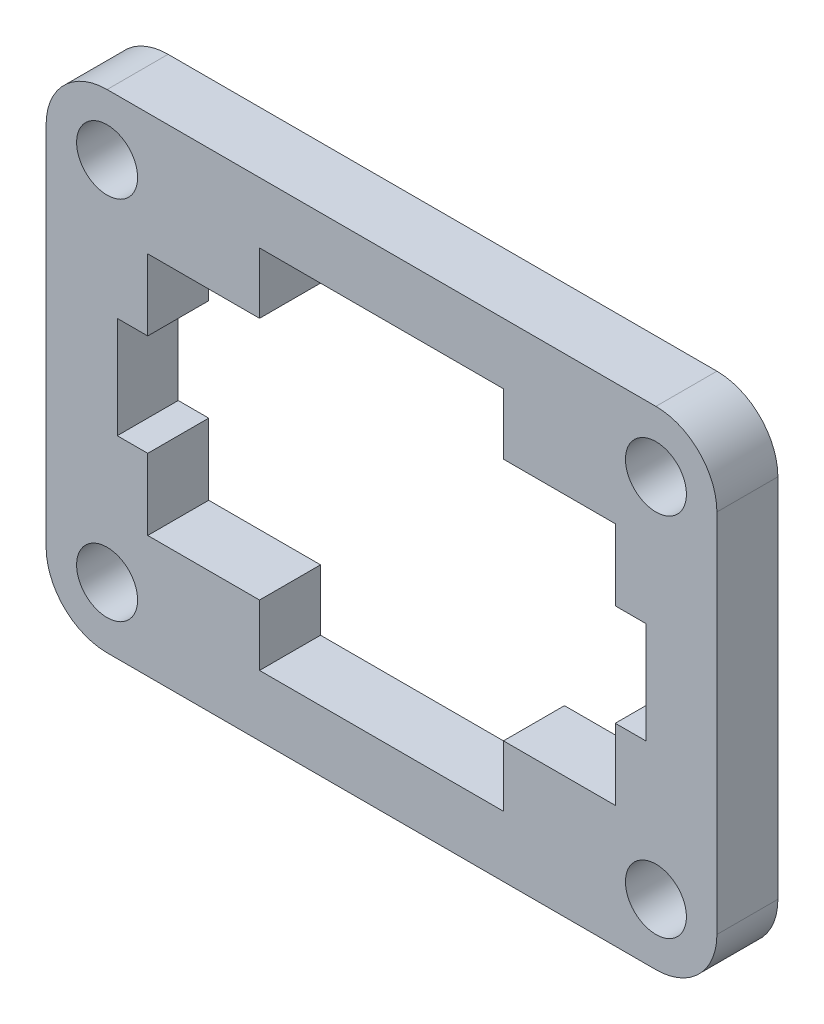
ISO-10303-21;
HEADER;
FILE_DESCRIPTION(('STEP AP214'),'2;1');
FILE_NAME('part.step','',(''),(''),'','','');
FILE_SCHEMA(('AUTOMOTIVE_DESIGN { 1 0 10303 214 1 1 1 1 }'));
ENDSEC;
DATA;
#1=APPLICATION_CONTEXT('core data for automotive mechanical design processes');
#2=APPLICATION_PROTOCOL_DEFINITION('international standard','automotive_design',2000,#1);
#3=PRODUCT_CONTEXT('',#1,'mechanical');
#4=PRODUCT('Part','Part','',(#3));
#5=PRODUCT_RELATED_PRODUCT_CATEGORY('part','',(#4));
#6=PRODUCT_DEFINITION_FORMATION('','',#4);
#7=PRODUCT_DEFINITION_CONTEXT('part definition',#1,'design');
#8=PRODUCT_DEFINITION('design','',#6,#7);
#9=PRODUCT_DEFINITION_SHAPE('','',#8);
#10=(LENGTH_UNIT() NAMED_UNIT(*) SI_UNIT(.MILLI.,.METRE.));
#11=(NAMED_UNIT(*) PLANE_ANGLE_UNIT() SI_UNIT($,.RADIAN.));
#12=(NAMED_UNIT(*) SI_UNIT($,.STERADIAN.) SOLID_ANGLE_UNIT());
#13=UNCERTAINTY_MEASURE_WITH_UNIT(LENGTH_MEASURE(1.E-05),#10,'distance_accuracy_value','');
#14=(GEOMETRIC_REPRESENTATION_CONTEXT(3) GLOBAL_UNCERTAINTY_ASSIGNED_CONTEXT((#13)) GLOBAL_UNIT_ASSIGNED_CONTEXT((#10,
#11,#12)) REPRESENTATION_CONTEXT('',''));
#15=CARTESIAN_POINT('',(0.,0.,0.));
#16=DIRECTION('',(0.,0.,1.));
#17=DIRECTION('',(1.,0.,0.));
#18=AXIS2_PLACEMENT_3D('',#15,#16,#17);
#19=CARTESIAN_POINT('',(27.0302510086011,-31.6514477462077,3.));
#20=DIRECTION('',(0.,0.,1.));
#21=DIRECTION('',(1.,0.,0.));
#22=AXIS2_PLACEMENT_3D('',#19,#20,#21);
#23=PLANE('',#22);
#24=CARTESIAN_POINT('',(54.0302510086011,-31.6514477462077,3.));
#25=DIRECTION('',(0.,0.,1.));
#26=DIRECTION('',(1.,0.,0.));
#27=AXIS2_PLACEMENT_3D('',#24,#25,#26);
#28=CIRCLE('',#27,1.5);
#29=CARTESIAN_POINT('',(55.5302510086011,-31.6514477462077,3.));
#30=VERTEX_POINT('',#29);
#31=EDGE_CURVE('E599',#30,#30,#28,.T.);
#32=ORIENTED_EDGE('',*,*,#31,.F.);
#33=EDGE_LOOP('',(#32));
#34=FACE_BOUND('',#33,.T.);
#35=CARTESIAN_POINT('',(27.0302510086011,-13.6514477462077,3.));
#36=DIRECTION('',(0.,0.,1.));
#37=DIRECTION('',(1.,0.,0.));
#38=AXIS2_PLACEMENT_3D('',#35,#36,#37);
#39=CIRCLE('',#38,1.5);
#40=CARTESIAN_POINT('',(28.5302510086011,-13.6514477462077,3.));
#41=VERTEX_POINT('',#40);
#42=EDGE_CURVE('E286',#41,#41,#39,.T.);
#43=ORIENTED_EDGE('',*,*,#42,.F.);
#44=EDGE_LOOP('',(#43));
#45=FACE_BOUND('',#44,.T.);
#46=CARTESIAN_POINT('',(27.0302510086011,-31.6514477462077,3.));
#47=DIRECTION('',(0.,0.,1.));
#48=DIRECTION('',(1.,0.,0.));
#49=AXIS2_PLACEMENT_3D('',#46,#47,#48);
#50=CIRCLE('',#49,3.);
#51=CARTESIAN_POINT('',(24.0302510086011,-31.6514477462077,3.));
#52=VERTEX_POINT('',#51);
#53=CARTESIAN_POINT('',(27.0302510086011,-34.6514477462077,3.));
#54=VERTEX_POINT('',#53);
#55=EDGE_CURVE('E376',#52,#54,#50,.T.);
#56=ORIENTED_EDGE('',*,*,#55,.T.);
#57=DIRECTION('',(1.,0.,0.));
#58=VECTOR('',#57,1.);
#59=CARTESIAN_POINT('',(27.0302510086011,-34.6514477462077,3.));
#60=LINE('',#59,#58);
#61=CARTESIAN_POINT('',(54.0302510086011,-34.6514477462077,3.));
#62=VERTEX_POINT('',#61);
#63=EDGE_CURVE('E379',#54,#62,#60,.T.);
#64=ORIENTED_EDGE('',*,*,#63,.T.);
#65=CARTESIAN_POINT('',(54.0302510086011,-31.6514477462077,3.));
#66=DIRECTION('',(0.,0.,1.));
#67=DIRECTION('',(1.,0.,0.));
#68=AXIS2_PLACEMENT_3D('',#65,#66,#67);
#69=CIRCLE('',#68,3.);
#70=CARTESIAN_POINT('',(57.0302510086011,-31.6514477462077,3.));
#71=VERTEX_POINT('',#70);
#72=EDGE_CURVE('E382',#62,#71,#69,.T.);
#73=ORIENTED_EDGE('',*,*,#72,.T.);
#74=DIRECTION('',(0.,1.,0.));
#75=VECTOR('',#74,1.);
#76=CARTESIAN_POINT('',(57.0302510086011,-13.6514477462077,3.));
#77=LINE('',#76,#75);
#78=CARTESIAN_POINT('',(57.0302510086011,-13.6514477462077,3.));
#79=VERTEX_POINT('',#78);
#80=EDGE_CURVE('E384',#71,#79,#77,.T.);
#81=ORIENTED_EDGE('',*,*,#80,.T.);
#82=CARTESIAN_POINT('',(54.0302510086011,-13.6514477462077,3.));
#83=DIRECTION('',(0.,0.,1.));
#84=DIRECTION('',(-1.,0.,0.));
#85=AXIS2_PLACEMENT_3D('',#82,#83,#84);
#86=CIRCLE('',#85,3.);
#87=CARTESIAN_POINT('',(54.0302510086011,-10.6514477462077,3.));
#88=VERTEX_POINT('',#87);
#89=EDGE_CURVE('E386',#79,#88,#86,.T.);
#90=ORIENTED_EDGE('',*,*,#89,.T.);
#91=DIRECTION('',(-1.,0.,0.));
#92=VECTOR('',#91,1.);
#93=CARTESIAN_POINT('',(27.0302510086011,-10.6514477462077,3.));
#94=LINE('',#93,#92);
#95=CARTESIAN_POINT('',(27.0302510086011,-10.6514477462077,3.));
#96=VERTEX_POINT('',#95);
#97=EDGE_CURVE('E388',#88,#96,#94,.T.);
#98=ORIENTED_EDGE('',*,*,#97,.T.);
#99=CARTESIAN_POINT('',(27.0302510086011,-13.6514477462077,3.));
#100=DIRECTION('',(0.,0.,1.));
#101=DIRECTION('',(1.,0.,0.));
#102=AXIS2_PLACEMENT_3D('',#99,#100,#101);
#103=CIRCLE('',#102,3.);
#104=CARTESIAN_POINT('',(24.0302510086011,-13.6514477462077,3.));
#105=VERTEX_POINT('',#104);
#106=EDGE_CURVE('E390',#96,#105,#103,.T.);
#107=ORIENTED_EDGE('',*,*,#106,.T.);
#108=DIRECTION('',(0.,-1.,0.));
#109=VECTOR('',#108,1.);
#110=CARTESIAN_POINT('',(24.0302510086011,-13.6514477462077,3.));
#111=LINE('',#110,#109);
#112=EDGE_CURVE('E392',#105,#52,#111,.T.);
#113=ORIENTED_EDGE('',*,*,#112,.T.);
#114=EDGE_LOOP('',(#56,#64,#73,#81,#90,#98,#107,#113));
#115=FACE_BOUND('',#114,.T.);
#116=DIRECTION('',(1.,0.,0.));
#117=VECTOR('',#116,1.);
#118=CARTESIAN_POINT('',(29.0302510086011,-28.6514477462077,3.));
#119=LINE('',#118,#117);
#120=CARTESIAN_POINT('',(29.0302510086011,-28.6514477462077,3.));
#121=VERTEX_POINT('',#120);
#122=CARTESIAN_POINT('',(34.5302510086011,-28.6514477462077,3.));
#123=VERTEX_POINT('',#122);
#124=EDGE_CURVE('E232',#121,#123,#119,.T.);
#125=ORIENTED_EDGE('',*,*,#124,.F.);
#126=DIRECTION('',(0.,-1.,0.));
#127=VECTOR('',#126,1.);
#128=CARTESIAN_POINT('',(29.0302510086011,-28.6514477462077,3.));
#129=LINE('',#128,#127);
#130=CARTESIAN_POINT('',(29.0302510086011,-25.1514477462077,3.));
#131=VERTEX_POINT('',#130);
#132=EDGE_CURVE('E224',#131,#121,#129,.T.);
#133=ORIENTED_EDGE('',*,*,#132,.F.);
#134=DIRECTION('',(1.,0.,0.));
#135=VECTOR('',#134,1.);
#136=CARTESIAN_POINT('',(27.5302510086011,-25.1514477462077,3.));
#137=LINE('',#136,#135);
#138=CARTESIAN_POINT('',(27.5302510086011,-25.1514477462077,3.));
#139=VERTEX_POINT('',#138);
#140=EDGE_CURVE('E283',#139,#131,#137,.T.);
#141=ORIENTED_EDGE('',*,*,#140,.F.);
#142=DIRECTION('',(0.,-1.,0.));
#143=VECTOR('',#142,1.);
#144=CARTESIAN_POINT('',(27.5302510086011,-20.1514477462077,3.));
#145=LINE('',#144,#143);
#146=CARTESIAN_POINT('',(27.5302510086011,-20.1514477462077,3.));
#147=VERTEX_POINT('',#146);
#148=EDGE_CURVE('E281',#147,#139,#145,.T.);
#149=ORIENTED_EDGE('',*,*,#148,.F.);
#150=DIRECTION('',(-1.,0.,0.));
#151=VECTOR('',#150,1.);
#152=CARTESIAN_POINT('',(27.5302510086011,-20.1514477462077,3.));
#153=LINE('',#152,#151);
#154=CARTESIAN_POINT('',(29.0302510086011,-20.1514477462077,3.));
#155=VERTEX_POINT('',#154);
#156=EDGE_CURVE('E279',#155,#147,#153,.T.);
#157=ORIENTED_EDGE('',*,*,#156,.F.);
#158=DIRECTION('',(0.,-1.,0.));
#159=VECTOR('',#158,1.);
#160=CARTESIAN_POINT('',(29.0302510086011,-20.1514477462077,3.));
#161=LINE('',#160,#159);
#162=CARTESIAN_POINT('',(29.0302510086011,-16.6514477462077,3.));
#163=VERTEX_POINT('',#162);
#164=EDGE_CURVE('E277',#163,#155,#161,.T.);
#165=ORIENTED_EDGE('',*,*,#164,.F.);
#166=DIRECTION('',(-1.,0.,0.));
#167=VECTOR('',#166,1.);
#168=CARTESIAN_POINT('',(29.0302510086011,-16.6514477462077,3.));
#169=LINE('',#168,#167);
#170=CARTESIAN_POINT('',(34.5302510086011,-16.6514477462077,3.));
#171=VERTEX_POINT('',#170);
#172=EDGE_CURVE('E275',#171,#163,#169,.T.);
#173=ORIENTED_EDGE('',*,*,#172,.F.);
#174=DIRECTION('',(0.,-1.,0.));
#175=VECTOR('',#174,1.);
#176=CARTESIAN_POINT('',(34.5302510086011,-16.6514477462077,3.));
#177=LINE('',#176,#175);
#178=CARTESIAN_POINT('',(34.5302510086011,-13.6514477462077,3.));
#179=VERTEX_POINT('',#178);
#180=EDGE_CURVE('E273',#179,#171,#177,.T.);
#181=ORIENTED_EDGE('',*,*,#180,.F.);
#182=DIRECTION('',(-1.,0.,0.));
#183=VECTOR('',#182,1.);
#184=CARTESIAN_POINT('',(46.5302510086011,-13.6514477462077,3.));
#185=LINE('',#184,#183);
#186=CARTESIAN_POINT('',(46.5302510086011,-13.6514477462077,3.));
#187=VERTEX_POINT('',#186);
#188=EDGE_CURVE('E271',#187,#179,#185,.T.);
#189=ORIENTED_EDGE('',*,*,#188,.F.);
#190=DIRECTION('',(0.,1.,0.));
#191=VECTOR('',#190,1.);
#192=CARTESIAN_POINT('',(46.5302510086011,-16.6514477462077,3.));
#193=LINE('',#192,#191);
#194=CARTESIAN_POINT('',(46.5302510086011,-16.6514477462077,3.));
#195=VERTEX_POINT('',#194);
#196=EDGE_CURVE('E269',#195,#187,#193,.T.);
#197=ORIENTED_EDGE('',*,*,#196,.F.);
#198=DIRECTION('',(-1.,0.,0.));
#199=VECTOR('',#198,1.);
#200=CARTESIAN_POINT('',(46.5302510086011,-16.6514477462077,3.));
#201=LINE('',#200,#199);
#202=CARTESIAN_POINT('',(52.0302510086011,-16.6514477462077,3.));
#203=VERTEX_POINT('',#202);
#204=EDGE_CURVE('E267',#203,#195,#201,.T.);
#205=ORIENTED_EDGE('',*,*,#204,.F.);
#206=DIRECTION('',(0.,1.,0.));
#207=VECTOR('',#206,1.);
#208=CARTESIAN_POINT('',(52.0302510086011,-20.1514477462077,3.));
#209=LINE('',#208,#207);
#210=CARTESIAN_POINT('',(52.0302510086011,-20.1514477462077,3.));
#211=VERTEX_POINT('',#210);
#212=EDGE_CURVE('E265',#211,#203,#209,.T.);
#213=ORIENTED_EDGE('',*,*,#212,.F.);
#214=DIRECTION('',(-1.,0.,0.));
#215=VECTOR('',#214,1.);
#216=CARTESIAN_POINT('',(52.0302510086011,-20.1514477462077,3.));
#217=LINE('',#216,#215);
#218=CARTESIAN_POINT('',(53.5302510086011,-20.1514477462077,3.));
#219=VERTEX_POINT('',#218);
#220=EDGE_CURVE('E263',#219,#211,#217,.T.);
#221=ORIENTED_EDGE('',*,*,#220,.F.);
#222=DIRECTION('',(0.,1.,0.));
#223=VECTOR('',#222,1.);
#224=CARTESIAN_POINT('',(53.5302510086011,-20.1514477462077,3.));
#225=LINE('',#224,#223);
#226=CARTESIAN_POINT('',(53.5302510086011,-25.1514477462077,3.));
#227=VERTEX_POINT('',#226);
#228=EDGE_CURVE('E261',#227,#219,#225,.T.);
#229=ORIENTED_EDGE('',*,*,#228,.F.);
#230=DIRECTION('',(1.,0.,0.));
#231=VECTOR('',#230,1.);
#232=CARTESIAN_POINT('',(52.0302510086011,-25.1514477462077,3.));
#233=LINE('',#232,#231);
#234=CARTESIAN_POINT('',(52.0302510086011,-25.1514477462077,3.));
#235=VERTEX_POINT('',#234);
#236=EDGE_CURVE('E259',#235,#227,#233,.T.);
#237=ORIENTED_EDGE('',*,*,#236,.F.);
#238=DIRECTION('',(0.,1.,0.));
#239=VECTOR('',#238,1.);
#240=CARTESIAN_POINT('',(52.0302510086011,-28.6514477462077,3.));
#241=LINE('',#240,#239);
#242=CARTESIAN_POINT('',(52.0302510086011,-28.6514477462077,3.));
#243=VERTEX_POINT('',#242);
#244=EDGE_CURVE('E257',#243,#235,#241,.T.);
#245=ORIENTED_EDGE('',*,*,#244,.F.);
#246=DIRECTION('',(1.,0.,0.));
#247=VECTOR('',#246,1.);
#248=CARTESIAN_POINT('',(46.5302510086011,-28.6514477462077,3.));
#249=LINE('',#248,#247);
#250=CARTESIAN_POINT('',(46.5302510086011,-28.6514477462077,3.));
#251=VERTEX_POINT('',#250);
#252=EDGE_CURVE('E255',#251,#243,#249,.T.);
#253=ORIENTED_EDGE('',*,*,#252,.F.);
#254=DIRECTION('',(0.,1.,0.));
#255=VECTOR('',#254,1.);
#256=CARTESIAN_POINT('',(46.5302510086011,-31.6514477462077,3.));
#257=LINE('',#256,#255);
#258=CARTESIAN_POINT('',(46.5302510086011,-31.6514477462077,3.));
#259=VERTEX_POINT('',#258);
#260=EDGE_CURVE('E253',#259,#251,#257,.T.);
#261=ORIENTED_EDGE('',*,*,#260,.F.);
#262=DIRECTION('',(1.,0.,0.));
#263=VECTOR('',#262,1.);
#264=CARTESIAN_POINT('',(46.5302510086011,-31.6514477462077,3.));
#265=LINE('',#264,#263);
#266=CARTESIAN_POINT('',(34.5302510086011,-31.6514477462077,3.));
#267=VERTEX_POINT('',#266);
#268=EDGE_CURVE('E248',#267,#259,#265,.T.);
#269=ORIENTED_EDGE('',*,*,#268,.F.);
#270=DIRECTION('',(0.,-1.,0.));
#271=VECTOR('',#270,1.);
#272=CARTESIAN_POINT('',(34.5302510086011,-31.6514477462077,3.));
#273=LINE('',#272,#271);
#274=EDGE_CURVE('E246',#123,#267,#273,.T.);
#275=ORIENTED_EDGE('',*,*,#274,.F.);
#276=EDGE_LOOP('',(#125,#133,#141,#149,#157,#165,#173,#181,#189,#197,#205,#213,#221,#229,#237,
#245,#253,#261,#269,#275));
#277=FACE_BOUND('',#276,.T.);
#278=CARTESIAN_POINT('',(54.0302510086011,-13.6514477462077,3.));
#279=DIRECTION('',(0.,0.,1.));
#280=DIRECTION('',(1.,0.,0.));
#281=AXIS2_PLACEMENT_3D('',#278,#279,#280);
#282=CIRCLE('',#281,1.5);
#283=CARTESIAN_POINT('',(55.5302510086011,-13.6514477462077,3.));
#284=VERTEX_POINT('',#283);
#285=EDGE_CURVE('E605',#284,#284,#282,.T.);
#286=ORIENTED_EDGE('',*,*,#285,.F.);
#287=EDGE_LOOP('',(#286));
#288=FACE_BOUND('',#287,.T.);
#289=CARTESIAN_POINT('',(27.0302510086011,-31.6514477462077,3.));
#290=DIRECTION('',(0.,0.,1.));
#291=DIRECTION('',(1.,0.,0.));
#292=AXIS2_PLACEMENT_3D('',#289,#290,#291);
#293=CIRCLE('',#292,1.5);
#294=CARTESIAN_POINT('',(28.5302510086011,-31.6514477462077,3.));
#295=VERTEX_POINT('',#294);
#296=EDGE_CURVE('E590',#295,#295,#293,.T.);
#297=ORIENTED_EDGE('',*,*,#296,.F.);
#298=EDGE_LOOP('',(#297));
#299=FACE_BOUND('',#298,.T.);
#300=ADVANCED_FACE('F39',(#34,#45,#115,#277,#288,#299),#23,.T.);
#301=CARTESIAN_POINT('',(27.0302510086011,-31.6514477462077,0.));
#302=DIRECTION('',(0.,0.,1.));
#303=DIRECTION('',(1.,0.,0.));
#304=AXIS2_PLACEMENT_3D('',#301,#302,#303);
#305=PLANE('',#304);
#306=CARTESIAN_POINT('',(54.0302510086011,-31.6514477462077,0.));
#307=DIRECTION('',(0.,0.,1.));
#308=DIRECTION('',(1.,0.,0.));
#309=AXIS2_PLACEMENT_3D('',#306,#307,#308);
#310=CIRCLE('',#309,1.5);
#311=CARTESIAN_POINT('',(55.5302510086011,-31.6514477462077,0.));
#312=VERTEX_POINT('',#311);
#313=EDGE_CURVE('E596',#312,#312,#310,.T.);
#314=ORIENTED_EDGE('',*,*,#313,.T.);
#315=EDGE_LOOP('',(#314));
#316=FACE_BOUND('',#315,.T.);
#317=CARTESIAN_POINT('',(27.0302510086011,-13.6514477462077,0.));
#318=DIRECTION('',(0.,0.,1.));
#319=DIRECTION('',(1.,0.,0.));
#320=AXIS2_PLACEMENT_3D('',#317,#318,#319);
#321=CIRCLE('',#320,1.5);
#322=CARTESIAN_POINT('',(28.5302510086011,-13.6514477462077,0.));
#323=VERTEX_POINT('',#322);
#324=EDGE_CURVE('E608',#323,#323,#321,.T.);
#325=ORIENTED_EDGE('',*,*,#324,.T.);
#326=EDGE_LOOP('',(#325));
#327=FACE_BOUND('',#326,.T.);
#328=CARTESIAN_POINT('',(27.0302510086011,-31.6514477462077,0.));
#329=DIRECTION('',(0.,0.,1.));
#330=DIRECTION('',(1.,0.,0.));
#331=AXIS2_PLACEMENT_3D('',#328,#329,#330);
#332=CIRCLE('',#331,3.);
#333=CARTESIAN_POINT('',(24.0302510086011,-31.6514477462077,0.));
#334=VERTEX_POINT('',#333);
#335=CARTESIAN_POINT('',(27.0302510086011,-34.6514477462077,0.));
#336=VERTEX_POINT('',#335);
#337=EDGE_CURVE('E240',#334,#336,#332,.T.);
#338=ORIENTED_EDGE('',*,*,#337,.F.);
#339=DIRECTION('',(0.,-1.,0.));
#340=VECTOR('',#339,1.);
#341=CARTESIAN_POINT('',(24.0302510086011,-13.6514477462077,0.));
#342=LINE('',#341,#340);
#343=CARTESIAN_POINT('',(24.0302510086011,-13.6514477462077,0.));
#344=VERTEX_POINT('',#343);
#345=EDGE_CURVE('E380',#344,#334,#342,.T.);
#346=ORIENTED_EDGE('',*,*,#345,.F.);
#347=CARTESIAN_POINT('',(27.0302510086011,-13.6514477462077,0.));
#348=DIRECTION('',(0.,0.,1.));
#349=DIRECTION('',(1.,0.,0.));
#350=AXIS2_PLACEMENT_3D('',#347,#348,#349);
#351=CIRCLE('',#350,3.);
#352=CARTESIAN_POINT('',(27.0302510086011,-10.6514477462077,0.));
#353=VERTEX_POINT('',#352);
#354=EDGE_CURVE('E407',#353,#344,#351,.T.);
#355=ORIENTED_EDGE('',*,*,#354,.F.);
#356=DIRECTION('',(-1.,0.,0.));
#357=VECTOR('',#356,1.);
#358=CARTESIAN_POINT('',(27.0302510086011,-10.6514477462077,0.));
#359=LINE('',#358,#357);
#360=CARTESIAN_POINT('',(54.0302510086011,-10.6514477462077,0.));
#361=VERTEX_POINT('',#360);
#362=EDGE_CURVE('E405',#361,#353,#359,.T.);
#363=ORIENTED_EDGE('',*,*,#362,.F.);
#364=CARTESIAN_POINT('',(54.0302510086011,-13.6514477462077,0.));
#365=DIRECTION('',(0.,0.,1.));
#366=DIRECTION('',(-1.,0.,0.));
#367=AXIS2_PLACEMENT_3D('',#364,#365,#366);
#368=CIRCLE('',#367,3.);
#369=CARTESIAN_POINT('',(57.0302510086011,-13.6514477462077,0.));
#370=VERTEX_POINT('',#369);
#371=EDGE_CURVE('E403',#370,#361,#368,.T.);
#372=ORIENTED_EDGE('',*,*,#371,.F.);
#373=DIRECTION('',(0.,1.,0.));
#374=VECTOR('',#373,1.);
#375=CARTESIAN_POINT('',(57.0302510086011,-13.6514477462077,0.));
#376=LINE('',#375,#374);
#377=CARTESIAN_POINT('',(57.0302510086011,-31.6514477462077,0.));
#378=VERTEX_POINT('',#377);
#379=EDGE_CURVE('E401',#378,#370,#376,.T.);
#380=ORIENTED_EDGE('',*,*,#379,.F.);
#381=CARTESIAN_POINT('',(54.0302510086011,-31.6514477462077,0.));
#382=DIRECTION('',(0.,0.,1.));
#383=DIRECTION('',(1.,0.,0.));
#384=AXIS2_PLACEMENT_3D('',#381,#382,#383);
#385=CIRCLE('',#384,3.);
#386=CARTESIAN_POINT('',(54.0302510086011,-34.6514477462077,0.));
#387=VERTEX_POINT('',#386);
#388=EDGE_CURVE('E399',#387,#378,#385,.T.);
#389=ORIENTED_EDGE('',*,*,#388,.F.);
#390=DIRECTION('',(1.,0.,0.));
#391=VECTOR('',#390,1.);
#392=CARTESIAN_POINT('',(27.0302510086011,-34.6514477462077,0.));
#393=LINE('',#392,#391);
#394=EDGE_CURVE('E397',#336,#387,#393,.T.);
#395=ORIENTED_EDGE('',*,*,#394,.F.);
#396=EDGE_LOOP('',(#338,#346,#355,#363,#372,#380,#389,#395));
#397=FACE_BOUND('',#396,.T.);
#398=DIRECTION('',(0.,-1.,0.));
#399=VECTOR('',#398,1.);
#400=CARTESIAN_POINT('',(29.0302510086011,-28.6514477462077,0.));
#401=LINE('',#400,#399);
#402=CARTESIAN_POINT('',(29.0302510086011,-25.1514477462077,0.));
#403=VERTEX_POINT('',#402);
#404=CARTESIAN_POINT('',(29.0302510086011,-28.6514477462077,0.));
#405=VERTEX_POINT('',#404);
#406=EDGE_CURVE('E62',#403,#405,#401,.T.);
#407=ORIENTED_EDGE('',*,*,#406,.T.);
#408=DIRECTION('',(1.,0.,0.));
#409=VECTOR('',#408,1.);
#410=CARTESIAN_POINT('',(29.0302510086011,-28.6514477462077,0.));
#411=LINE('',#410,#409);
#412=CARTESIAN_POINT('',(34.5302510086011,-28.6514477462077,0.));
#413=VERTEX_POINT('',#412);
#414=EDGE_CURVE('E239',#405,#413,#411,.T.);
#415=ORIENTED_EDGE('',*,*,#414,.T.);
#416=DIRECTION('',(0.,-1.,0.));
#417=VECTOR('',#416,1.);
#418=CARTESIAN_POINT('',(34.5302510086011,-31.6514477462077,0.));
#419=LINE('',#418,#417);
#420=CARTESIAN_POINT('',(34.5302510086011,-31.6514477462077,0.));
#421=VERTEX_POINT('',#420);
#422=EDGE_CURVE('E288',#413,#421,#419,.T.);
#423=ORIENTED_EDGE('',*,*,#422,.T.);
#424=DIRECTION('',(1.,0.,0.));
#425=VECTOR('',#424,1.);
#426=CARTESIAN_POINT('',(46.5302510086011,-31.6514477462077,0.));
#427=LINE('',#426,#425);
#428=CARTESIAN_POINT('',(46.5302510086011,-31.6514477462077,0.));
#429=VERTEX_POINT('',#428);
#430=EDGE_CURVE('E291',#421,#429,#427,.T.);
#431=ORIENTED_EDGE('',*,*,#430,.T.);
#432=DIRECTION('',(0.,1.,0.));
#433=VECTOR('',#432,1.);
#434=CARTESIAN_POINT('',(46.5302510086011,-31.6514477462077,0.));
#435=LINE('',#434,#433);
#436=CARTESIAN_POINT('',(46.5302510086011,-28.6514477462077,0.));
#437=VERTEX_POINT('',#436);
#438=EDGE_CURVE('E294',#429,#437,#435,.T.);
#439=ORIENTED_EDGE('',*,*,#438,.T.);
#440=DIRECTION('',(1.,0.,0.));
#441=VECTOR('',#440,1.);
#442=CARTESIAN_POINT('',(46.5302510086011,-28.6514477462077,0.));
#443=LINE('',#442,#441);
#444=CARTESIAN_POINT('',(52.0302510086011,-28.6514477462077,0.));
#445=VERTEX_POINT('',#444);
#446=EDGE_CURVE('E297',#437,#445,#443,.T.);
#447=ORIENTED_EDGE('',*,*,#446,.T.);
#448=DIRECTION('',(0.,1.,0.));
#449=VECTOR('',#448,1.);
#450=CARTESIAN_POINT('',(52.0302510086011,-28.6514477462077,0.));
#451=LINE('',#450,#449);
#452=CARTESIAN_POINT('',(52.0302510086011,-25.1514477462077,0.));
#453=VERTEX_POINT('',#452);
#454=EDGE_CURVE('E300',#445,#453,#451,.T.);
#455=ORIENTED_EDGE('',*,*,#454,.T.);
#456=DIRECTION('',(1.,0.,0.));
#457=VECTOR('',#456,1.);
#458=CARTESIAN_POINT('',(52.0302510086011,-25.1514477462077,0.));
#459=LINE('',#458,#457);
#460=CARTESIAN_POINT('',(53.5302510086011,-25.1514477462077,0.));
#461=VERTEX_POINT('',#460);
#462=EDGE_CURVE('E303',#453,#461,#459,.T.);
#463=ORIENTED_EDGE('',*,*,#462,.T.);
#464=DIRECTION('',(0.,1.,0.));
#465=VECTOR('',#464,1.);
#466=CARTESIAN_POINT('',(53.5302510086011,-20.1514477462077,0.));
#467=LINE('',#466,#465);
#468=CARTESIAN_POINT('',(53.5302510086011,-20.1514477462077,0.));
#469=VERTEX_POINT('',#468);
#470=EDGE_CURVE('E306',#461,#469,#467,.T.);
#471=ORIENTED_EDGE('',*,*,#470,.T.);
#472=DIRECTION('',(-1.,0.,0.));
#473=VECTOR('',#472,1.);
#474=CARTESIAN_POINT('',(52.0302510086011,-20.1514477462077,0.));
#475=LINE('',#474,#473);
#476=CARTESIAN_POINT('',(52.0302510086011,-20.1514477462077,0.));
#477=VERTEX_POINT('',#476);
#478=EDGE_CURVE('E309',#469,#477,#475,.T.);
#479=ORIENTED_EDGE('',*,*,#478,.T.);
#480=DIRECTION('',(0.,1.,0.));
#481=VECTOR('',#480,1.);
#482=CARTESIAN_POINT('',(52.0302510086011,-20.1514477462077,0.));
#483=LINE('',#482,#481);
#484=CARTESIAN_POINT('',(52.0302510086011,-16.6514477462077,0.));
#485=VERTEX_POINT('',#484);
#486=EDGE_CURVE('E312',#477,#485,#483,.T.);
#487=ORIENTED_EDGE('',*,*,#486,.T.);
#488=DIRECTION('',(-1.,0.,0.));
#489=VECTOR('',#488,1.);
#490=CARTESIAN_POINT('',(46.5302510086011,-16.6514477462077,0.));
#491=LINE('',#490,#489);
#492=CARTESIAN_POINT('',(46.5302510086011,-16.6514477462077,0.));
#493=VERTEX_POINT('',#492);
#494=EDGE_CURVE('E315',#485,#493,#491,.T.);
#495=ORIENTED_EDGE('',*,*,#494,.T.);
#496=DIRECTION('',(0.,1.,0.));
#497=VECTOR('',#496,1.);
#498=CARTESIAN_POINT('',(46.5302510086011,-16.6514477462077,0.));
#499=LINE('',#498,#497);
#500=CARTESIAN_POINT('',(46.5302510086011,-13.6514477462077,0.));
#501=VERTEX_POINT('',#500);
#502=EDGE_CURVE('E318',#493,#501,#499,.T.);
#503=ORIENTED_EDGE('',*,*,#502,.T.);
#504=DIRECTION('',(-1.,0.,0.));
#505=VECTOR('',#504,1.);
#506=CARTESIAN_POINT('',(46.5302510086011,-13.6514477462077,0.));
#507=LINE('',#506,#505);
#508=CARTESIAN_POINT('',(34.5302510086011,-13.6514477462077,0.));
#509=VERTEX_POINT('',#508);
#510=EDGE_CURVE('E321',#501,#509,#507,.T.);
#511=ORIENTED_EDGE('',*,*,#510,.T.);
#512=DIRECTION('',(0.,-1.,0.));
#513=VECTOR('',#512,1.);
#514=CARTESIAN_POINT('',(34.5302510086011,-16.6514477462077,0.));
#515=LINE('',#514,#513);
#516=CARTESIAN_POINT('',(34.5302510086011,-16.6514477462077,0.));
#517=VERTEX_POINT('',#516);
#518=EDGE_CURVE('E324',#509,#517,#515,.T.);
#519=ORIENTED_EDGE('',*,*,#518,.T.);
#520=DIRECTION('',(-1.,0.,0.));
#521=VECTOR('',#520,1.);
#522=CARTESIAN_POINT('',(29.0302510086011,-16.6514477462077,0.));
#523=LINE('',#522,#521);
#524=CARTESIAN_POINT('',(29.0302510086011,-16.6514477462077,0.));
#525=VERTEX_POINT('',#524);
#526=EDGE_CURVE('E327',#517,#525,#523,.T.);
#527=ORIENTED_EDGE('',*,*,#526,.T.);
#528=DIRECTION('',(0.,-1.,0.));
#529=VECTOR('',#528,1.);
#530=CARTESIAN_POINT('',(29.0302510086011,-20.1514477462077,0.));
#531=LINE('',#530,#529);
#532=CARTESIAN_POINT('',(29.0302510086011,-20.1514477462077,0.));
#533=VERTEX_POINT('',#532);
#534=EDGE_CURVE('E330',#525,#533,#531,.T.);
#535=ORIENTED_EDGE('',*,*,#534,.T.);
#536=DIRECTION('',(-1.,0.,0.));
#537=VECTOR('',#536,1.);
#538=CARTESIAN_POINT('',(27.5302510086011,-20.1514477462077,0.));
#539=LINE('',#538,#537);
#540=CARTESIAN_POINT('',(27.5302510086011,-20.1514477462077,0.));
#541=VERTEX_POINT('',#540);
#542=EDGE_CURVE('E333',#533,#541,#539,.T.);
#543=ORIENTED_EDGE('',*,*,#542,.T.);
#544=DIRECTION('',(0.,-1.,0.));
#545=VECTOR('',#544,1.);
#546=CARTESIAN_POINT('',(27.5302510086011,-20.1514477462077,0.));
#547=LINE('',#546,#545);
#548=CARTESIAN_POINT('',(27.5302510086011,-25.1514477462077,0.));
#549=VERTEX_POINT('',#548);
#550=EDGE_CURVE('E336',#541,#549,#547,.T.);
#551=ORIENTED_EDGE('',*,*,#550,.T.);
#552=DIRECTION('',(1.,0.,0.));
#553=VECTOR('',#552,1.);
#554=CARTESIAN_POINT('',(27.5302510086011,-25.1514477462077,0.));
#555=LINE('',#554,#553);
#556=EDGE_CURVE('E233',#549,#403,#555,.T.);
#557=ORIENTED_EDGE('',*,*,#556,.T.);
#558=EDGE_LOOP('',(#407,#415,#423,#431,#439,#447,#455,#463,#471,#479,#487,#495,#503,#511,#519,
#527,#535,#543,#551,#557));
#559=FACE_BOUND('',#558,.T.);
#560=CARTESIAN_POINT('',(54.0302510086011,-13.6514477462077,0.));
#561=DIRECTION('',(0.,0.,1.));
#562=DIRECTION('',(1.,0.,0.));
#563=AXIS2_PLACEMENT_3D('',#560,#561,#562);
#564=CIRCLE('',#563,1.5);
#565=CARTESIAN_POINT('',(55.5302510086011,-13.6514477462077,0.));
#566=VERTEX_POINT('',#565);
#567=EDGE_CURVE('E602',#566,#566,#564,.T.);
#568=ORIENTED_EDGE('',*,*,#567,.T.);
#569=EDGE_LOOP('',(#568));
#570=FACE_BOUND('',#569,.T.);
#571=CARTESIAN_POINT('',(27.0302510086011,-31.6514477462077,0.));
#572=DIRECTION('',(0.,0.,1.));
#573=DIRECTION('',(1.,0.,0.));
#574=AXIS2_PLACEMENT_3D('',#571,#572,#573);
#575=CIRCLE('',#574,1.5);
#576=CARTESIAN_POINT('',(28.5302510086011,-31.6514477462077,0.));
#577=VERTEX_POINT('',#576);
#578=EDGE_CURVE('E593',#577,#577,#575,.T.);
#579=ORIENTED_EDGE('',*,*,#578,.T.);
#580=EDGE_LOOP('',(#579));
#581=FACE_BOUND('',#580,.T.);
#582=ADVANCED_FACE('F437',(#316,#327,#397,#559,#570,#581),#305,.F.);
#583=CARTESIAN_POINT('',(27.0302510086011,-31.6514477462077,3.));
#584=DIRECTION('',(0.,0.,-1.));
#585=DIRECTION('',(-1.,0.,0.));
#586=AXIS2_PLACEMENT_3D('',#583,#584,#585);
#587=CYLINDRICAL_SURFACE('',#586,3.);
#588=ORIENTED_EDGE('',*,*,#337,.T.);
#589=DIRECTION('',(0.,0.,-1.));
#590=VECTOR('',#589,1.);
#591=CARTESIAN_POINT('',(27.0302510086011,-34.6514477462077,3.));
#592=LINE('',#591,#590);
#593=EDGE_CURVE('E11',#54,#336,#592,.T.);
#594=ORIENTED_EDGE('',*,*,#593,.F.);
#595=ORIENTED_EDGE('',*,*,#55,.F.);
#596=DIRECTION('',(0.,0.,-1.));
#597=VECTOR('',#596,1.);
#598=CARTESIAN_POINT('',(24.0302510086011,-31.6514477462077,3.));
#599=LINE('',#598,#597);
#600=EDGE_CURVE('E394',#52,#334,#599,.T.);
#601=ORIENTED_EDGE('',*,*,#600,.T.);
#602=EDGE_LOOP('',(#588,#594,#595,#601));
#603=FACE_BOUND('',#602,.T.);
#604=ADVANCED_FACE('F41',(#603),#587,.T.);
#605=CARTESIAN_POINT('',(27.0302510086011,-34.6514477462077,3.));
#606=DIRECTION('',(0.,1.,0.));
#607=DIRECTION('',(0.,0.,1.));
#608=AXIS2_PLACEMENT_3D('',#605,#606,#607);
#609=PLANE('',#608);
#610=ORIENTED_EDGE('',*,*,#394,.T.);
#611=DIRECTION('',(0.,0.,-1.));
#612=VECTOR('',#611,1.);
#613=CARTESIAN_POINT('',(54.0302510086011,-34.6514477462077,3.));
#614=LINE('',#613,#612);
#615=EDGE_CURVE('E47',#62,#387,#614,.T.);
#616=ORIENTED_EDGE('',*,*,#615,.F.);
#617=ORIENTED_EDGE('',*,*,#63,.F.);
#618=ORIENTED_EDGE('',*,*,#593,.T.);
#619=EDGE_LOOP('',(#610,#616,#617,#618));
#620=FACE_BOUND('',#619,.T.);
#621=ADVANCED_FACE('F454',(#620),#609,.F.);
#622=CARTESIAN_POINT('',(54.0302510086011,-31.6514477462077,3.));
#623=DIRECTION('',(0.,0.,-1.));
#624=DIRECTION('',(-1.,0.,0.));
#625=AXIS2_PLACEMENT_3D('',#622,#623,#624);
#626=CYLINDRICAL_SURFACE('',#625,3.);
#627=ORIENTED_EDGE('',*,*,#388,.T.);
#628=DIRECTION('',(0.,0.,-1.));
#629=VECTOR('',#628,1.);
#630=CARTESIAN_POINT('',(57.0302510086011,-31.6514477462077,3.));
#631=LINE('',#630,#629);
#632=EDGE_CURVE('E424',#71,#378,#631,.T.);
#633=ORIENTED_EDGE('',*,*,#632,.F.);
#634=ORIENTED_EDGE('',*,*,#72,.F.);
#635=ORIENTED_EDGE('',*,*,#615,.T.);
#636=EDGE_LOOP('',(#627,#633,#634,#635));
#637=FACE_BOUND('',#636,.T.);
#638=ADVANCED_FACE('F431',(#637),#626,.T.);
#639=CARTESIAN_POINT('',(57.0302510086011,-13.6514477462077,3.));
#640=DIRECTION('',(-1.,0.,0.));
#641=DIRECTION('',(0.,-1.,0.));
#642=AXIS2_PLACEMENT_3D('',#639,#640,#641);
#643=PLANE('',#642);
#644=ORIENTED_EDGE('',*,*,#379,.T.);
#645=DIRECTION('',(0.,0.,-1.));
#646=VECTOR('',#645,1.);
#647=CARTESIAN_POINT('',(57.0302510086011,-13.6514477462077,3.));
#648=LINE('',#647,#646);
#649=EDGE_CURVE('E421',#79,#370,#648,.T.);
#650=ORIENTED_EDGE('',*,*,#649,.F.);
#651=ORIENTED_EDGE('',*,*,#80,.F.);
#652=ORIENTED_EDGE('',*,*,#632,.T.);
#653=EDGE_LOOP('',(#644,#650,#651,#652));
#654=FACE_BOUND('',#653,.T.);
#655=ADVANCED_FACE('F443',(#654),#643,.F.);
#656=CARTESIAN_POINT('',(54.0302510086011,-13.6514477462077,3.));
#657=DIRECTION('',(0.,0.,-1.));
#658=DIRECTION('',(-1.,0.,0.));
#659=AXIS2_PLACEMENT_3D('',#656,#657,#658);
#660=CYLINDRICAL_SURFACE('',#659,3.);
#661=ORIENTED_EDGE('',*,*,#371,.T.);
#662=DIRECTION('',(0.,0.,-1.));
#663=VECTOR('',#662,1.);
#664=CARTESIAN_POINT('',(54.0302510086011,-10.6514477462077,3.));
#665=LINE('',#664,#663);
#666=EDGE_CURVE('E418',#88,#361,#665,.T.);
#667=ORIENTED_EDGE('',*,*,#666,.F.);
#668=ORIENTED_EDGE('',*,*,#89,.F.);
#669=ORIENTED_EDGE('',*,*,#649,.T.);
#670=EDGE_LOOP('',(#661,#667,#668,#669));
#671=FACE_BOUND('',#670,.T.);
#672=ADVANCED_FACE('F447',(#671),#660,.T.);
#673=CARTESIAN_POINT('',(27.0302510086011,-10.6514477462077,3.));
#674=DIRECTION('',(0.,-1.,0.));
#675=DIRECTION('',(0.,0.,-1.));
#676=AXIS2_PLACEMENT_3D('',#673,#674,#675);
#677=PLANE('',#676);
#678=ORIENTED_EDGE('',*,*,#362,.T.);
#679=DIRECTION('',(0.,0.,-1.));
#680=VECTOR('',#679,1.);
#681=CARTESIAN_POINT('',(27.0302510086011,-10.6514477462077,3.));
#682=LINE('',#681,#680);
#683=EDGE_CURVE('E415',#96,#353,#682,.T.);
#684=ORIENTED_EDGE('',*,*,#683,.F.);
#685=ORIENTED_EDGE('',*,*,#97,.F.);
#686=ORIENTED_EDGE('',*,*,#666,.T.);
#687=EDGE_LOOP('',(#678,#684,#685,#686));
#688=FACE_BOUND('',#687,.T.);
#689=ADVANCED_FACE('F467',(#688),#677,.F.);
#690=CARTESIAN_POINT('',(27.0302510086011,-13.6514477462077,3.));
#691=DIRECTION('',(0.,0.,-1.));
#692=DIRECTION('',(-1.,0.,0.));
#693=AXIS2_PLACEMENT_3D('',#690,#691,#692);
#694=CYLINDRICAL_SURFACE('',#693,3.);
#695=ORIENTED_EDGE('',*,*,#354,.T.);
#696=DIRECTION('',(0.,0.,-1.));
#697=VECTOR('',#696,1.);
#698=CARTESIAN_POINT('',(24.0302510086011,-13.6514477462077,3.));
#699=LINE('',#698,#697);
#700=EDGE_CURVE('E412',#105,#344,#699,.T.);
#701=ORIENTED_EDGE('',*,*,#700,.F.);
#702=ORIENTED_EDGE('',*,*,#106,.F.);
#703=ORIENTED_EDGE('',*,*,#683,.T.);
#704=EDGE_LOOP('',(#695,#701,#702,#703));
#705=FACE_BOUND('',#704,.T.);
#706=ADVANCED_FACE('F465',(#705),#694,.T.);
#707=CARTESIAN_POINT('',(24.0302510086011,-13.6514477462077,3.));
#708=DIRECTION('',(1.,0.,0.));
#709=DIRECTION('',(0.,1.,0.));
#710=AXIS2_PLACEMENT_3D('',#707,#708,#709);
#711=PLANE('',#710);
#712=ORIENTED_EDGE('',*,*,#345,.T.);
#713=ORIENTED_EDGE('',*,*,#600,.F.);
#714=ORIENTED_EDGE('',*,*,#112,.F.);
#715=ORIENTED_EDGE('',*,*,#700,.T.);
#716=EDGE_LOOP('',(#712,#713,#714,#715));
#717=FACE_BOUND('',#716,.T.);
#718=ADVANCED_FACE('F460',(#717),#711,.F.);
#719=CARTESIAN_POINT('',(29.0302510086011,-28.6514477462077,3.));
#720=DIRECTION('',(1.,0.,0.));
#721=DIRECTION('',(0.,0.,-1.));
#722=AXIS2_PLACEMENT_3D('',#719,#720,#721);
#723=PLANE('',#722);
#724=ORIENTED_EDGE('',*,*,#406,.F.);
#725=DIRECTION('',(0.,0.,-1.));
#726=VECTOR('',#725,1.);
#727=CARTESIAN_POINT('',(29.0302510086011,-25.1514477462077,3.));
#728=LINE('',#727,#726);
#729=EDGE_CURVE('E228',#131,#403,#728,.T.);
#730=ORIENTED_EDGE('',*,*,#729,.F.);
#731=ORIENTED_EDGE('',*,*,#132,.T.);
#732=DIRECTION('',(0.,0.,-1.));
#733=VECTOR('',#732,1.);
#734=CARTESIAN_POINT('',(29.0302510086011,-28.6514477462077,3.));
#735=LINE('',#734,#733);
#736=EDGE_CURVE('E227',#121,#405,#735,.T.);
#737=ORIENTED_EDGE('',*,*,#736,.T.);
#738=EDGE_LOOP('',(#724,#730,#731,#737));
#739=FACE_BOUND('',#738,.T.);
#740=ADVANCED_FACE('F226',(#739),#723,.T.);
#741=CARTESIAN_POINT('',(29.0302510086011,-28.6514477462077,3.));
#742=DIRECTION('',(0.,1.,0.));
#743=DIRECTION('',(0.,0.,1.));
#744=AXIS2_PLACEMENT_3D('',#741,#742,#743);
#745=PLANE('',#744);
#746=ORIENTED_EDGE('',*,*,#414,.F.);
#747=ORIENTED_EDGE('',*,*,#736,.F.);
#748=ORIENTED_EDGE('',*,*,#124,.T.);
#749=DIRECTION('',(0.,0.,-1.));
#750=VECTOR('',#749,1.);
#751=CARTESIAN_POINT('',(34.5302510086011,-28.6514477462077,3.));
#752=LINE('',#751,#750);
#753=EDGE_CURVE('E241',#123,#413,#752,.T.);
#754=ORIENTED_EDGE('',*,*,#753,.T.);
#755=EDGE_LOOP('',(#746,#747,#748,#754));
#756=FACE_BOUND('',#755,.T.);
#757=ADVANCED_FACE('F236',(#756),#745,.T.);
#758=CARTESIAN_POINT('',(34.5302510086011,-31.6514477462077,3.));
#759=DIRECTION('',(1.,0.,0.));
#760=DIRECTION('',(0.,0.,-1.));
#761=AXIS2_PLACEMENT_3D('',#758,#759,#760);
#762=PLANE('',#761);
#763=ORIENTED_EDGE('',*,*,#422,.F.);
#764=ORIENTED_EDGE('',*,*,#753,.F.);
#765=ORIENTED_EDGE('',*,*,#274,.T.);
#766=DIRECTION('',(0.,0.,-1.));
#767=VECTOR('',#766,1.);
#768=CARTESIAN_POINT('',(34.5302510086011,-31.6514477462077,3.));
#769=LINE('',#768,#767);
#770=EDGE_CURVE('E373',#267,#421,#769,.T.);
#771=ORIENTED_EDGE('',*,*,#770,.T.);
#772=EDGE_LOOP('',(#763,#764,#765,#771));
#773=FACE_BOUND('',#772,.T.);
#774=ADVANCED_FACE('F496',(#773),#762,.T.);
#775=CARTESIAN_POINT('',(46.5302510086011,-31.6514477462077,3.));
#776=DIRECTION('',(0.,1.,0.));
#777=DIRECTION('',(0.,0.,1.));
#778=AXIS2_PLACEMENT_3D('',#775,#776,#777);
#779=PLANE('',#778);
#780=ORIENTED_EDGE('',*,*,#430,.F.);
#781=ORIENTED_EDGE('',*,*,#770,.F.);
#782=ORIENTED_EDGE('',*,*,#268,.T.);
#783=DIRECTION('',(0.,0.,-1.));
#784=VECTOR('',#783,1.);
#785=CARTESIAN_POINT('',(46.5302510086011,-31.6514477462077,3.));
#786=LINE('',#785,#784);
#787=EDGE_CURVE('E371',#259,#429,#786,.T.);
#788=ORIENTED_EDGE('',*,*,#787,.T.);
#789=EDGE_LOOP('',(#780,#781,#782,#788));
#790=FACE_BOUND('',#789,.T.);
#791=ADVANCED_FACE('F500',(#790),#779,.T.);
#792=CARTESIAN_POINT('',(46.5302510086011,-31.6514477462077,3.));
#793=DIRECTION('',(-1.,0.,0.));
#794=DIRECTION('',(0.,0.,1.));
#795=AXIS2_PLACEMENT_3D('',#792,#793,#794);
#796=PLANE('',#795);
#797=ORIENTED_EDGE('',*,*,#438,.F.);
#798=ORIENTED_EDGE('',*,*,#787,.F.);
#799=ORIENTED_EDGE('',*,*,#260,.T.);
#800=DIRECTION('',(0.,0.,-1.));
#801=VECTOR('',#800,1.);
#802=CARTESIAN_POINT('',(46.5302510086011,-28.6514477462077,3.));
#803=LINE('',#802,#801);
#804=EDGE_CURVE('E369',#251,#437,#803,.T.);
#805=ORIENTED_EDGE('',*,*,#804,.T.);
#806=EDGE_LOOP('',(#797,#798,#799,#805));
#807=FACE_BOUND('',#806,.T.);
#808=ADVANCED_FACE('F506',(#807),#796,.T.);
#809=CARTESIAN_POINT('',(46.5302510086011,-28.6514477462077,3.));
#810=DIRECTION('',(0.,1.,0.));
#811=DIRECTION('',(0.,0.,1.));
#812=AXIS2_PLACEMENT_3D('',#809,#810,#811);
#813=PLANE('',#812);
#814=ORIENTED_EDGE('',*,*,#446,.F.);
#815=ORIENTED_EDGE('',*,*,#804,.F.);
#816=ORIENTED_EDGE('',*,*,#252,.T.);
#817=DIRECTION('',(0.,0.,-1.));
#818=VECTOR('',#817,1.);
#819=CARTESIAN_POINT('',(52.0302510086011,-28.6514477462077,3.));
#820=LINE('',#819,#818);
#821=EDGE_CURVE('E367',#243,#445,#820,.T.);
#822=ORIENTED_EDGE('',*,*,#821,.T.);
#823=EDGE_LOOP('',(#814,#815,#816,#822));
#824=FACE_BOUND('',#823,.T.);
#825=ADVANCED_FACE('F510',(#824),#813,.T.);
#826=CARTESIAN_POINT('',(52.0302510086011,-28.6514477462077,3.));
#827=DIRECTION('',(-1.,0.,0.));
#828=DIRECTION('',(0.,0.,1.));
#829=AXIS2_PLACEMENT_3D('',#826,#827,#828);
#830=PLANE('',#829);
#831=ORIENTED_EDGE('',*,*,#454,.F.);
#832=ORIENTED_EDGE('',*,*,#821,.F.);
#833=ORIENTED_EDGE('',*,*,#244,.T.);
#834=DIRECTION('',(0.,0.,-1.));
#835=VECTOR('',#834,1.);
#836=CARTESIAN_POINT('',(52.0302510086011,-25.1514477462077,3.));
#837=LINE('',#836,#835);
#838=EDGE_CURVE('E365',#235,#453,#837,.T.);
#839=ORIENTED_EDGE('',*,*,#838,.T.);
#840=EDGE_LOOP('',(#831,#832,#833,#839));
#841=FACE_BOUND('',#840,.T.);
#842=ADVANCED_FACE('F514',(#841),#830,.T.);
#843=CARTESIAN_POINT('',(52.0302510086011,-25.1514477462077,3.));
#844=DIRECTION('',(0.,1.,0.));
#845=DIRECTION('',(0.,0.,1.));
#846=AXIS2_PLACEMENT_3D('',#843,#844,#845);
#847=PLANE('',#846);
#848=ORIENTED_EDGE('',*,*,#462,.F.);
#849=ORIENTED_EDGE('',*,*,#838,.F.);
#850=ORIENTED_EDGE('',*,*,#236,.T.);
#851=DIRECTION('',(0.,0.,-1.));
#852=VECTOR('',#851,1.);
#853=CARTESIAN_POINT('',(53.5302510086011,-25.1514477462077,3.));
#854=LINE('',#853,#852);
#855=EDGE_CURVE('E363',#227,#461,#854,.T.);
#856=ORIENTED_EDGE('',*,*,#855,.T.);
#857=EDGE_LOOP('',(#848,#849,#850,#856));
#858=FACE_BOUND('',#857,.T.);
#859=ADVANCED_FACE('F518',(#858),#847,.T.);
#860=CARTESIAN_POINT('',(53.5302510086011,-20.1514477462077,3.));
#861=DIRECTION('',(-1.,0.,0.));
#862=DIRECTION('',(0.,0.,1.));
#863=AXIS2_PLACEMENT_3D('',#860,#861,#862);
#864=PLANE('',#863);
#865=ORIENTED_EDGE('',*,*,#470,.F.);
#866=ORIENTED_EDGE('',*,*,#855,.F.);
#867=ORIENTED_EDGE('',*,*,#228,.T.);
#868=DIRECTION('',(0.,0.,-1.));
#869=VECTOR('',#868,1.);
#870=CARTESIAN_POINT('',(53.5302510086011,-20.1514477462077,3.));
#871=LINE('',#870,#869);
#872=EDGE_CURVE('E361',#219,#469,#871,.T.);
#873=ORIENTED_EDGE('',*,*,#872,.T.);
#874=EDGE_LOOP('',(#865,#866,#867,#873));
#875=FACE_BOUND('',#874,.T.);
#876=ADVANCED_FACE('F522',(#875),#864,.T.);
#877=CARTESIAN_POINT('',(52.0302510086011,-20.1514477462077,3.));
#878=DIRECTION('',(0.,-1.,0.));
#879=DIRECTION('',(0.,0.,-1.));
#880=AXIS2_PLACEMENT_3D('',#877,#878,#879);
#881=PLANE('',#880);
#882=ORIENTED_EDGE('',*,*,#478,.F.);
#883=ORIENTED_EDGE('',*,*,#872,.F.);
#884=ORIENTED_EDGE('',*,*,#220,.T.);
#885=DIRECTION('',(0.,0.,-1.));
#886=VECTOR('',#885,1.);
#887=CARTESIAN_POINT('',(52.0302510086011,-20.1514477462077,3.));
#888=LINE('',#887,#886);
#889=EDGE_CURVE('E359',#211,#477,#888,.T.);
#890=ORIENTED_EDGE('',*,*,#889,.T.);
#891=EDGE_LOOP('',(#882,#883,#884,#890));
#892=FACE_BOUND('',#891,.T.);
#893=ADVANCED_FACE('F526',(#892),#881,.T.);
#894=CARTESIAN_POINT('',(52.0302510086011,-20.1514477462077,3.));
#895=DIRECTION('',(-1.,0.,0.));
#896=DIRECTION('',(0.,0.,1.));
#897=AXIS2_PLACEMENT_3D('',#894,#895,#896);
#898=PLANE('',#897);
#899=ORIENTED_EDGE('',*,*,#486,.F.);
#900=ORIENTED_EDGE('',*,*,#889,.F.);
#901=ORIENTED_EDGE('',*,*,#212,.T.);
#902=DIRECTION('',(0.,0.,-1.));
#903=VECTOR('',#902,1.);
#904=CARTESIAN_POINT('',(52.0302510086011,-16.6514477462077,3.));
#905=LINE('',#904,#903);
#906=EDGE_CURVE('E357',#203,#485,#905,.T.);
#907=ORIENTED_EDGE('',*,*,#906,.T.);
#908=EDGE_LOOP('',(#899,#900,#901,#907));
#909=FACE_BOUND('',#908,.T.);
#910=ADVANCED_FACE('F530',(#909),#898,.T.);
#911=CARTESIAN_POINT('',(46.5302510086011,-16.6514477462077,3.));
#912=DIRECTION('',(0.,-1.,0.));
#913=DIRECTION('',(0.,0.,-1.));
#914=AXIS2_PLACEMENT_3D('',#911,#912,#913);
#915=PLANE('',#914);
#916=ORIENTED_EDGE('',*,*,#494,.F.);
#917=ORIENTED_EDGE('',*,*,#906,.F.);
#918=ORIENTED_EDGE('',*,*,#204,.T.);
#919=DIRECTION('',(0.,0.,-1.));
#920=VECTOR('',#919,1.);
#921=CARTESIAN_POINT('',(46.5302510086011,-16.6514477462077,3.));
#922=LINE('',#921,#920);
#923=EDGE_CURVE('E355',#195,#493,#922,.T.);
#924=ORIENTED_EDGE('',*,*,#923,.T.);
#925=EDGE_LOOP('',(#916,#917,#918,#924));
#926=FACE_BOUND('',#925,.T.);
#927=ADVANCED_FACE('F534',(#926),#915,.T.);
#928=CARTESIAN_POINT('',(46.5302510086011,-16.6514477462077,3.));
#929=DIRECTION('',(-1.,0.,0.));
#930=DIRECTION('',(0.,0.,1.));
#931=AXIS2_PLACEMENT_3D('',#928,#929,#930);
#932=PLANE('',#931);
#933=ORIENTED_EDGE('',*,*,#502,.F.);
#934=ORIENTED_EDGE('',*,*,#923,.F.);
#935=ORIENTED_EDGE('',*,*,#196,.T.);
#936=DIRECTION('',(0.,0.,-1.));
#937=VECTOR('',#936,1.);
#938=CARTESIAN_POINT('',(46.5302510086011,-13.6514477462077,3.));
#939=LINE('',#938,#937);
#940=EDGE_CURVE('E353',#187,#501,#939,.T.);
#941=ORIENTED_EDGE('',*,*,#940,.T.);
#942=EDGE_LOOP('',(#933,#934,#935,#941));
#943=FACE_BOUND('',#942,.T.);
#944=ADVANCED_FACE('F538',(#943),#932,.T.);
#945=CARTESIAN_POINT('',(46.5302510086011,-13.6514477462077,3.));
#946=DIRECTION('',(0.,-1.,0.));
#947=DIRECTION('',(0.,0.,-1.));
#948=AXIS2_PLACEMENT_3D('',#945,#946,#947);
#949=PLANE('',#948);
#950=ORIENTED_EDGE('',*,*,#510,.F.);
#951=ORIENTED_EDGE('',*,*,#940,.F.);
#952=ORIENTED_EDGE('',*,*,#188,.T.);
#953=DIRECTION('',(0.,0.,-1.));
#954=VECTOR('',#953,1.);
#955=CARTESIAN_POINT('',(34.5302510086011,-13.6514477462077,3.));
#956=LINE('',#955,#954);
#957=EDGE_CURVE('E351',#179,#509,#956,.T.);
#958=ORIENTED_EDGE('',*,*,#957,.T.);
#959=EDGE_LOOP('',(#950,#951,#952,#958));
#960=FACE_BOUND('',#959,.T.);
#961=ADVANCED_FACE('F542',(#960),#949,.T.);
#962=CARTESIAN_POINT('',(34.5302510086011,-16.6514477462077,3.));
#963=DIRECTION('',(1.,0.,0.));
#964=DIRECTION('',(0.,0.,-1.));
#965=AXIS2_PLACEMENT_3D('',#962,#963,#964);
#966=PLANE('',#965);
#967=ORIENTED_EDGE('',*,*,#518,.F.);
#968=ORIENTED_EDGE('',*,*,#957,.F.);
#969=ORIENTED_EDGE('',*,*,#180,.T.);
#970=DIRECTION('',(0.,0.,-1.));
#971=VECTOR('',#970,1.);
#972=CARTESIAN_POINT('',(34.5302510086011,-16.6514477462077,3.));
#973=LINE('',#972,#971);
#974=EDGE_CURVE('E349',#171,#517,#973,.T.);
#975=ORIENTED_EDGE('',*,*,#974,.T.);
#976=EDGE_LOOP('',(#967,#968,#969,#975));
#977=FACE_BOUND('',#976,.T.);
#978=ADVANCED_FACE('F546',(#977),#966,.T.);
#979=CARTESIAN_POINT('',(29.0302510086011,-16.6514477462077,3.));
#980=DIRECTION('',(0.,-1.,0.));
#981=DIRECTION('',(0.,0.,-1.));
#982=AXIS2_PLACEMENT_3D('',#979,#980,#981);
#983=PLANE('',#982);
#984=ORIENTED_EDGE('',*,*,#526,.F.);
#985=ORIENTED_EDGE('',*,*,#974,.F.);
#986=ORIENTED_EDGE('',*,*,#172,.T.);
#987=DIRECTION('',(0.,0.,-1.));
#988=VECTOR('',#987,1.);
#989=CARTESIAN_POINT('',(29.0302510086011,-16.6514477462077,3.));
#990=LINE('',#989,#988);
#991=EDGE_CURVE('E347',#163,#525,#990,.T.);
#992=ORIENTED_EDGE('',*,*,#991,.T.);
#993=EDGE_LOOP('',(#984,#985,#986,#992));
#994=FACE_BOUND('',#993,.T.);
#995=ADVANCED_FACE('F550',(#994),#983,.T.);
#996=CARTESIAN_POINT('',(29.0302510086011,-20.1514477462077,3.));
#997=DIRECTION('',(1.,0.,0.));
#998=DIRECTION('',(0.,0.,-1.));
#999=AXIS2_PLACEMENT_3D('',#996,#997,#998);
#1000=PLANE('',#999);
#1001=ORIENTED_EDGE('',*,*,#534,.F.);
#1002=ORIENTED_EDGE('',*,*,#991,.F.);
#1003=ORIENTED_EDGE('',*,*,#164,.T.);
#1004=DIRECTION('',(0.,0.,-1.));
#1005=VECTOR('',#1004,1.);
#1006=CARTESIAN_POINT('',(29.0302510086011,-20.1514477462077,3.));
#1007=LINE('',#1006,#1005);
#1008=EDGE_CURVE('E345',#155,#533,#1007,.T.);
#1009=ORIENTED_EDGE('',*,*,#1008,.T.);
#1010=EDGE_LOOP('',(#1001,#1002,#1003,#1009));
#1011=FACE_BOUND('',#1010,.T.);
#1012=ADVANCED_FACE('F554',(#1011),#1000,.T.);
#1013=CARTESIAN_POINT('',(27.5302510086011,-20.1514477462077,3.));
#1014=DIRECTION('',(0.,-1.,0.));
#1015=DIRECTION('',(0.,0.,-1.));
#1016=AXIS2_PLACEMENT_3D('',#1013,#1014,#1015);
#1017=PLANE('',#1016);
#1018=ORIENTED_EDGE('',*,*,#542,.F.);
#1019=ORIENTED_EDGE('',*,*,#1008,.F.);
#1020=ORIENTED_EDGE('',*,*,#156,.T.);
#1021=DIRECTION('',(0.,0.,-1.));
#1022=VECTOR('',#1021,1.);
#1023=CARTESIAN_POINT('',(27.5302510086011,-20.1514477462077,3.));
#1024=LINE('',#1023,#1022);
#1025=EDGE_CURVE('E343',#147,#541,#1024,.T.);
#1026=ORIENTED_EDGE('',*,*,#1025,.T.);
#1027=EDGE_LOOP('',(#1018,#1019,#1020,#1026));
#1028=FACE_BOUND('',#1027,.T.);
#1029=ADVANCED_FACE('F558',(#1028),#1017,.T.);
#1030=CARTESIAN_POINT('',(27.5302510086011,-20.1514477462077,3.));
#1031=DIRECTION('',(1.,0.,0.));
#1032=DIRECTION('',(0.,0.,-1.));
#1033=AXIS2_PLACEMENT_3D('',#1030,#1031,#1032);
#1034=PLANE('',#1033);
#1035=ORIENTED_EDGE('',*,*,#550,.F.);
#1036=ORIENTED_EDGE('',*,*,#1025,.F.);
#1037=ORIENTED_EDGE('',*,*,#148,.T.);
#1038=DIRECTION('',(0.,0.,-1.));
#1039=VECTOR('',#1038,1.);
#1040=CARTESIAN_POINT('',(27.5302510086011,-25.1514477462077,3.));
#1041=LINE('',#1040,#1039);
#1042=EDGE_CURVE('E54',#139,#549,#1041,.T.);
#1043=ORIENTED_EDGE('',*,*,#1042,.T.);
#1044=EDGE_LOOP('',(#1035,#1036,#1037,#1043));
#1045=FACE_BOUND('',#1044,.T.);
#1046=ADVANCED_FACE('F562',(#1045),#1034,.T.);
#1047=CARTESIAN_POINT('',(27.5302510086011,-25.1514477462077,3.));
#1048=DIRECTION('',(0.,1.,0.));
#1049=DIRECTION('',(0.,0.,1.));
#1050=AXIS2_PLACEMENT_3D('',#1047,#1048,#1049);
#1051=PLANE('',#1050);
#1052=ORIENTED_EDGE('',*,*,#556,.F.);
#1053=ORIENTED_EDGE('',*,*,#1042,.F.);
#1054=ORIENTED_EDGE('',*,*,#140,.T.);
#1055=ORIENTED_EDGE('',*,*,#729,.T.);
#1056=EDGE_LOOP('',(#1052,#1053,#1054,#1055));
#1057=FACE_BOUND('',#1056,.T.);
#1058=ADVANCED_FACE('F566',(#1057),#1051,.T.);
#1059=CARTESIAN_POINT('',(27.0302510086011,-13.6514477462077,3.));
#1060=DIRECTION('',(0.,0.,-1.));
#1061=DIRECTION('',(-1.,0.,0.));
#1062=AXIS2_PLACEMENT_3D('',#1059,#1060,#1061);
#1063=CYLINDRICAL_SURFACE('',#1062,1.5);
#1064=ORIENTED_EDGE('',*,*,#42,.T.);
#1065=EDGE_LOOP('',(#1064));
#1066=FACE_BOUND('',#1065,.T.);
#1067=ORIENTED_EDGE('',*,*,#324,.F.);
#1068=EDGE_LOOP('',(#1067));
#1069=FACE_BOUND('',#1068,.T.);
#1070=ADVANCED_FACE('F570',(#1066,#1069),#1063,.F.);
#1071=CARTESIAN_POINT('',(54.0302510086011,-13.6514477462077,3.));
#1072=DIRECTION('',(0.,0.,-1.));
#1073=DIRECTION('',(-1.,0.,0.));
#1074=AXIS2_PLACEMENT_3D('',#1071,#1072,#1073);
#1075=CYLINDRICAL_SURFACE('',#1074,1.5);
#1076=ORIENTED_EDGE('',*,*,#285,.T.);
#1077=EDGE_LOOP('',(#1076));
#1078=FACE_BOUND('',#1077,.T.);
#1079=ORIENTED_EDGE('',*,*,#567,.F.);
#1080=EDGE_LOOP('',(#1079));
#1081=FACE_BOUND('',#1080,.T.);
#1082=ADVANCED_FACE('F573',(#1078,#1081),#1075,.F.);
#1083=CARTESIAN_POINT('',(54.0302510086011,-31.6514477462077,3.));
#1084=DIRECTION('',(0.,0.,-1.));
#1085=DIRECTION('',(-1.,0.,0.));
#1086=AXIS2_PLACEMENT_3D('',#1083,#1084,#1085);
#1087=CYLINDRICAL_SURFACE('',#1086,1.5);
#1088=ORIENTED_EDGE('',*,*,#31,.T.);
#1089=EDGE_LOOP('',(#1088));
#1090=FACE_BOUND('',#1089,.T.);
#1091=ORIENTED_EDGE('',*,*,#313,.F.);
#1092=EDGE_LOOP('',(#1091));
#1093=FACE_BOUND('',#1092,.T.);
#1094=ADVANCED_FACE('F577',(#1090,#1093),#1087,.F.);
#1095=CARTESIAN_POINT('',(27.0302510086011,-31.6514477462077,3.));
#1096=DIRECTION('',(0.,0.,-1.));
#1097=DIRECTION('',(-1.,0.,0.));
#1098=AXIS2_PLACEMENT_3D('',#1095,#1096,#1097);
#1099=CYLINDRICAL_SURFACE('',#1098,1.5);
#1100=ORIENTED_EDGE('',*,*,#296,.T.);
#1101=EDGE_LOOP('',(#1100));
#1102=FACE_BOUND('',#1101,.T.);
#1103=ORIENTED_EDGE('',*,*,#578,.F.);
#1104=EDGE_LOOP('',(#1103));
#1105=FACE_BOUND('',#1104,.T.);
#1106=ADVANCED_FACE('F581',(#1102,#1105),#1099,.F.);
#1107=CLOSED_SHELL('',(#300,#582,#604,#621,#638,#655,#672,#689,#706,#718,#740,#757,#774,#791,
#808,#825,#842,#859,#876,#893,#910,#927,#944,#961,#978,#995,#1012,#1029,#1046,#1058,#1070,#1082,
#1094,#1106));
#1108=MANIFOLD_SOLID_BREP('B2',#1107);
#1109=ADVANCED_BREP_SHAPE_REPRESENTATION('',(#18,#1108),#14);
#1110=SHAPE_DEFINITION_REPRESENTATION(#9,#1109);
ENDSEC;
END-ISO-10303-21;
